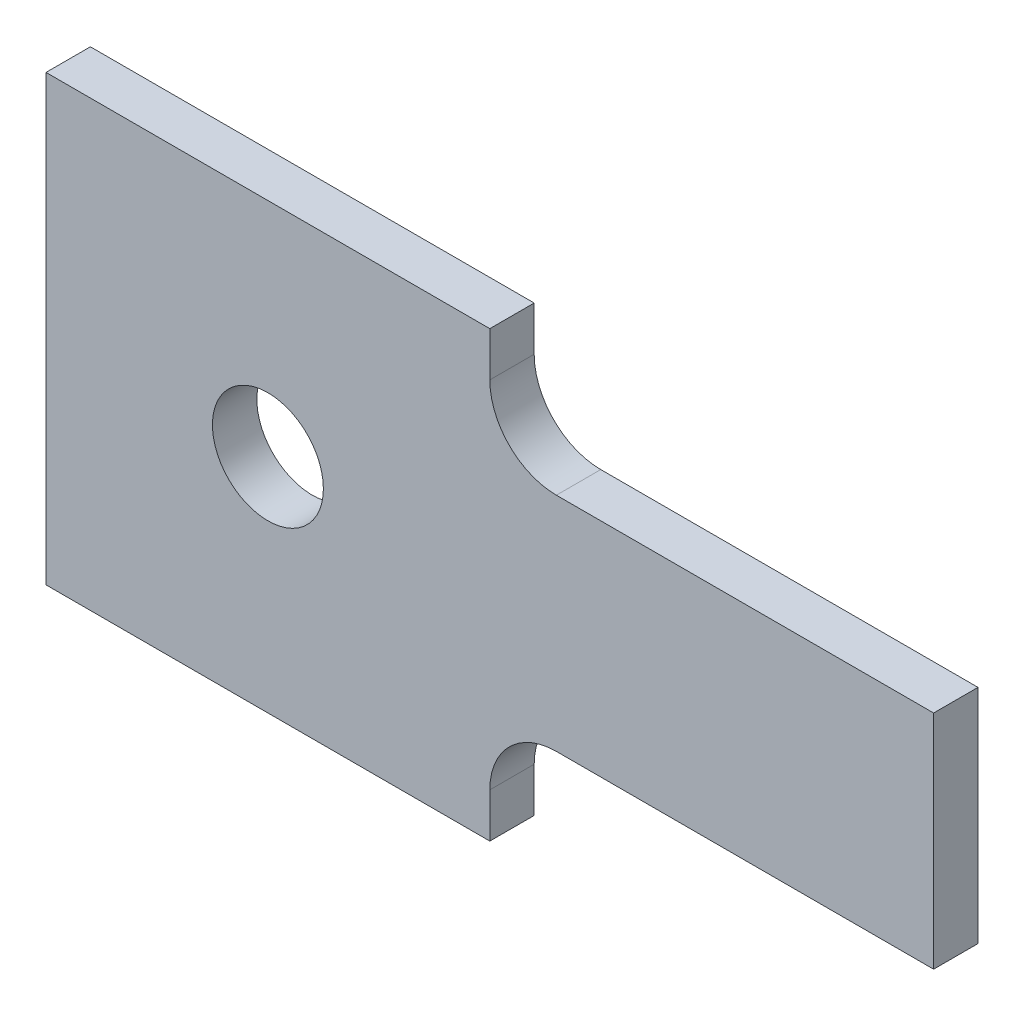
ISO-10303-21;
HEADER;
FILE_DESCRIPTION(('STEP AP214'),'2;1');
FILE_NAME('part.step','',(''),(''),'','','');
FILE_SCHEMA(('AUTOMOTIVE_DESIGN { 1 0 10303 214 1 1 1 1 }'));
ENDSEC;
DATA;
#1=APPLICATION_CONTEXT('core data for automotive mechanical design processes');
#2=APPLICATION_PROTOCOL_DEFINITION('international standard','automotive_design',2000,#1);
#3=PRODUCT_CONTEXT('',#1,'mechanical');
#4=PRODUCT('Part','Part','',(#3));
#5=PRODUCT_RELATED_PRODUCT_CATEGORY('part','',(#4));
#6=PRODUCT_DEFINITION_FORMATION('','',#4);
#7=PRODUCT_DEFINITION_CONTEXT('part definition',#1,'design');
#8=PRODUCT_DEFINITION('design','',#6,#7);
#9=PRODUCT_DEFINITION_SHAPE('','',#8);
#10=(LENGTH_UNIT() NAMED_UNIT(*) SI_UNIT(.MILLI.,.METRE.));
#11=(NAMED_UNIT(*) PLANE_ANGLE_UNIT() SI_UNIT($,.RADIAN.));
#12=(NAMED_UNIT(*) SI_UNIT($,.STERADIAN.) SOLID_ANGLE_UNIT());
#13=UNCERTAINTY_MEASURE_WITH_UNIT(LENGTH_MEASURE(1.E-05),#10,'distance_accuracy_value','');
#14=(GEOMETRIC_REPRESENTATION_CONTEXT(3) GLOBAL_UNCERTAINTY_ASSIGNED_CONTEXT((#13)) GLOBAL_UNIT_ASSIGNED_CONTEXT((#10,
#11,#12)) REPRESENTATION_CONTEXT('',''));
#15=CARTESIAN_POINT('',(0.,0.,0.));
#16=DIRECTION('',(0.,0.,1.));
#17=DIRECTION('',(1.,0.,0.));
#18=AXIS2_PLACEMENT_3D('',#15,#16,#17);
#19=CARTESIAN_POINT('',(0.,50.,10.));
#20=DIRECTION('',(1.,0.,0.));
#21=DIRECTION('',(0.,0.,-1.));
#22=AXIS2_PLACEMENT_3D('',#19,#20,#21);
#23=PLANE('',#22);
#24=DIRECTION('',(0.,-1.,0.));
#25=VECTOR('',#24,1.);
#26=CARTESIAN_POINT('',(0.,50.,5.));
#27=LINE('',#26,#25);
#28=CARTESIAN_POINT('',(0.,0.,5.));
#29=VERTEX_POINT('',#28);
#30=CARTESIAN_POINT('',(0.,-50.,5.));
#31=VERTEX_POINT('',#30);
#32=EDGE_CURVE('E11',#29,#31,#27,.T.);
#33=ORIENTED_EDGE('',*,*,#32,.F.);
#34=DIRECTION('',(0.,0.,1.));
#35=VECTOR('',#34,1.);
#36=CARTESIAN_POINT('',(0.,0.,10.));
#37=LINE('',#36,#35);
#38=CARTESIAN_POINT('',(0.,0.,0.));
#39=VERTEX_POINT('',#38);
#40=EDGE_CURVE('E159',#39,#29,#37,.T.);
#41=ORIENTED_EDGE('',*,*,#40,.F.);
#42=DIRECTION('',(0.,-1.,0.));
#43=VECTOR('',#42,1.);
#44=CARTESIAN_POINT('',(0.,50.,0.));
#45=LINE('',#44,#43);
#46=CARTESIAN_POINT('',(0.,-50.,0.));
#47=VERTEX_POINT('',#46);
#48=EDGE_CURVE('E193',#39,#47,#45,.T.);
#49=ORIENTED_EDGE('',*,*,#48,.T.);
#50=DIRECTION('',(0.,0.,-1.));
#51=VECTOR('',#50,1.);
#52=CARTESIAN_POINT('',(0.,-50.,10.));
#53=LINE('',#52,#51);
#54=EDGE_CURVE('E232',#31,#47,#53,.T.);
#55=ORIENTED_EDGE('',*,*,#54,.F.);
#56=EDGE_LOOP('',(#33,#41,#49,#55));
#57=FACE_BOUND('',#56,.T.);
#58=ADVANCED_FACE('F42',(#57),#23,.F.);
#59=DIRECTION('',(0.,-1.,0.));
#60=VECTOR('',#59,1.);
#61=CARTESIAN_POINT('',(0.,50.,5.));
#62=LINE('',#61,#60);
#63=CARTESIAN_POINT('',(0.,50.,5.));
#64=VERTEX_POINT('',#63);
#65=EDGE_CURVE('E46',#64,#29,#62,.T.);
#66=ORIENTED_EDGE('',*,*,#65,.F.);
#67=DIRECTION('',(0.,0.,-1.));
#68=VECTOR('',#67,1.);
#69=CARTESIAN_POINT('',(0.,50.,10.));
#70=LINE('',#69,#68);
#71=CARTESIAN_POINT('',(0.,50.,0.));
#72=VERTEX_POINT('',#71);
#73=EDGE_CURVE('E156',#64,#72,#70,.T.);
#74=ORIENTED_EDGE('',*,*,#73,.T.);
#75=EDGE_CURVE('E195',#72,#39,#45,.T.);
#76=ORIENTED_EDGE('',*,*,#75,.T.);
#77=ORIENTED_EDGE('',*,*,#40,.T.);
#78=EDGE_LOOP('',(#66,#74,#76,#77));
#79=FACE_BOUND('',#78,.T.);
#80=ADVANCED_FACE('F276',(#79),#23,.F.);
#81=CARTESIAN_POINT('',(0.,0.,10.));
#82=VERTEX_POINT('',#81);
#83=EDGE_CURVE('E139',#29,#82,#37,.T.);
#84=ORIENTED_EDGE('',*,*,#83,.F.);
#85=ORIENTED_EDGE('',*,*,#32,.T.);
#86=CARTESIAN_POINT('',(0.,-50.,10.));
#87=VERTEX_POINT('',#86);
#88=EDGE_CURVE('E161',#87,#31,#53,.T.);
#89=ORIENTED_EDGE('',*,*,#88,.F.);
#90=DIRECTION('',(0.,-1.,0.));
#91=VECTOR('',#90,1.);
#92=CARTESIAN_POINT('',(0.,50.,10.));
#93=LINE('',#92,#91);
#94=EDGE_CURVE('E143',#82,#87,#93,.T.);
#95=ORIENTED_EDGE('',*,*,#94,.F.);
#96=EDGE_LOOP('',(#84,#85,#89,#95));
#97=FACE_BOUND('',#96,.T.);
#98=ADVANCED_FACE('F171',(#97),#23,.F.);
#99=CARTESIAN_POINT('',(100.,50.,10.));
#100=DIRECTION('',(0.,-1.,0.));
#101=DIRECTION('',(1.,0.,0.));
#102=AXIS2_PLACEMENT_3D('',#99,#100,#101);
#103=PLANE('',#102);
#104=DIRECTION('',(-1.,0.,0.));
#105=VECTOR('',#104,1.);
#106=CARTESIAN_POINT('',(100.,50.,0.));
#107=LINE('',#106,#105);
#108=CARTESIAN_POINT('',(100.,50.,0.));
#109=VERTEX_POINT('',#108);
#110=EDGE_CURVE('E191',#109,#72,#107,.T.);
#111=ORIENTED_EDGE('',*,*,#110,.T.);
#112=ORIENTED_EDGE('',*,*,#73,.F.);
#113=CARTESIAN_POINT('',(0.,50.,10.));
#114=VERTEX_POINT('',#113);
#115=EDGE_CURVE('E138',#114,#64,#70,.T.);
#116=ORIENTED_EDGE('',*,*,#115,.F.);
#117=DIRECTION('',(-1.,0.,0.));
#118=VECTOR('',#117,1.);
#119=CARTESIAN_POINT('',(100.,50.,10.));
#120=LINE('',#119,#118);
#121=CARTESIAN_POINT('',(100.,50.,10.));
#122=VERTEX_POINT('',#121);
#123=EDGE_CURVE('E146',#122,#114,#120,.T.);
#124=ORIENTED_EDGE('',*,*,#123,.F.);
#125=DIRECTION('',(0.,0.,-1.));
#126=VECTOR('',#125,1.);
#127=CARTESIAN_POINT('',(100.,50.,10.));
#128=LINE('',#127,#126);
#129=EDGE_CURVE('E190',#122,#109,#128,.T.);
#130=ORIENTED_EDGE('',*,*,#129,.T.);
#131=EDGE_LOOP('',(#111,#112,#116,#124,#130));
#132=FACE_BOUND('',#131,.T.);
#133=ADVANCED_FACE('F44',(#132),#103,.F.);
#134=ORIENTED_EDGE('',*,*,#115,.T.);
#135=ORIENTED_EDGE('',*,*,#65,.T.);
#136=ORIENTED_EDGE('',*,*,#83,.T.);
#137=EDGE_CURVE('E134',#114,#82,#93,.T.);
#138=ORIENTED_EDGE('',*,*,#137,.F.);
#139=EDGE_LOOP('',(#134,#135,#136,#138));
#140=FACE_BOUND('',#139,.T.);
#141=ADVANCED_FACE('F136',(#140),#23,.F.);
#142=CARTESIAN_POINT('',(100.,-50.,10.));
#143=DIRECTION('',(0.,1.,0.));
#144=DIRECTION('',(-1.,0.,0.));
#145=AXIS2_PLACEMENT_3D('',#142,#143,#144);
#146=PLANE('',#145);
#147=DIRECTION('',(1.,0.,0.));
#148=VECTOR('',#147,1.);
#149=CARTESIAN_POINT('',(100.,-50.,0.));
#150=LINE('',#149,#148);
#151=CARTESIAN_POINT('',(100.,-50.,0.));
#152=VERTEX_POINT('',#151);
#153=EDGE_CURVE('E197',#47,#152,#150,.T.);
#154=ORIENTED_EDGE('',*,*,#153,.T.);
#155=DIRECTION('',(0.,0.,-1.));
#156=VECTOR('',#155,1.);
#157=CARTESIAN_POINT('',(100.,-50.,10.));
#158=LINE('',#157,#156);
#159=CARTESIAN_POINT('',(100.,-50.,10.));
#160=VERTEX_POINT('',#159);
#161=EDGE_CURVE('E230',#160,#152,#158,.T.);
#162=ORIENTED_EDGE('',*,*,#161,.F.);
#163=DIRECTION('',(1.,0.,0.));
#164=VECTOR('',#163,1.);
#165=CARTESIAN_POINT('',(100.,-50.,10.));
#166=LINE('',#165,#164);
#167=EDGE_CURVE('E142',#87,#160,#166,.T.);
#168=ORIENTED_EDGE('',*,*,#167,.F.);
#169=ORIENTED_EDGE('',*,*,#88,.T.);
#170=ORIENTED_EDGE('',*,*,#54,.T.);
#171=EDGE_LOOP('',(#154,#162,#168,#169,#170));
#172=FACE_BOUND('',#171,.T.);
#173=ADVANCED_FACE('F239',(#172),#146,.F.);
#174=CARTESIAN_POINT('',(100.,-40.0000000000001,10.));
#175=DIRECTION('',(-1.,0.,0.));
#176=DIRECTION('',(0.,0.,1.));
#177=AXIS2_PLACEMENT_3D('',#174,#175,#176);
#178=PLANE('',#177);
#179=DIRECTION('',(0.,1.,0.));
#180=VECTOR('',#179,1.);
#181=CARTESIAN_POINT('',(100.,-40.0000000000001,0.));
#182=LINE('',#181,#180);
#183=CARTESIAN_POINT('',(100.,-40.0000000000001,0.));
#184=VERTEX_POINT('',#183);
#185=EDGE_CURVE('E199',#152,#184,#182,.T.);
#186=ORIENTED_EDGE('',*,*,#185,.T.);
#187=DIRECTION('',(0.,0.,-1.));
#188=VECTOR('',#187,1.);
#189=CARTESIAN_POINT('',(100.,-40.0000000000001,10.));
#190=LINE('',#189,#188);
#191=CARTESIAN_POINT('',(100.,-40.0000000000001,10.));
#192=VERTEX_POINT('',#191);
#193=EDGE_CURVE('E228',#192,#184,#190,.T.);
#194=ORIENTED_EDGE('',*,*,#193,.F.);
#195=DIRECTION('',(0.,1.,0.));
#196=VECTOR('',#195,1.);
#197=CARTESIAN_POINT('',(100.,-40.0000000000001,10.));
#198=LINE('',#197,#196);
#199=EDGE_CURVE('E177',#160,#192,#198,.T.);
#200=ORIENTED_EDGE('',*,*,#199,.F.);
#201=ORIENTED_EDGE('',*,*,#161,.T.);
#202=EDGE_LOOP('',(#186,#194,#200,#201));
#203=FACE_BOUND('',#202,.T.);
#204=ADVANCED_FACE('F243',(#203),#178,.F.);
#205=CARTESIAN_POINT('',(115.,-40.,10.));
#206=DIRECTION('',(0.,0.,-1.));
#207=DIRECTION('',(-1.,0.,0.));
#208=AXIS2_PLACEMENT_3D('',#205,#206,#207);
#209=CYLINDRICAL_SURFACE('',#208,15.);
#210=CARTESIAN_POINT('',(115.,-40.,0.));
#211=DIRECTION('',(0.,0.,-1.));
#212=DIRECTION('',(1.,0.,0.));
#213=AXIS2_PLACEMENT_3D('',#210,#211,#212);
#214=CIRCLE('',#213,15.);
#215=CARTESIAN_POINT('',(115.,-25.,0.));
#216=VERTEX_POINT('',#215);
#217=EDGE_CURVE('E201',#184,#216,#214,.T.);
#218=ORIENTED_EDGE('',*,*,#217,.T.);
#219=DIRECTION('',(0.,0.,-1.));
#220=VECTOR('',#219,1.);
#221=CARTESIAN_POINT('',(115.,-25.,10.));
#222=LINE('',#221,#220);
#223=CARTESIAN_POINT('',(115.,-25.,10.));
#224=VERTEX_POINT('',#223);
#225=EDGE_CURVE('E225',#224,#216,#222,.T.);
#226=ORIENTED_EDGE('',*,*,#225,.F.);
#227=CARTESIAN_POINT('',(115.,-40.,10.));
#228=DIRECTION('',(0.,0.,-1.));
#229=DIRECTION('',(1.,0.,0.));
#230=AXIS2_PLACEMENT_3D('',#227,#228,#229);
#231=CIRCLE('',#230,15.);
#232=EDGE_CURVE('E179',#192,#224,#231,.T.);
#233=ORIENTED_EDGE('',*,*,#232,.F.);
#234=ORIENTED_EDGE('',*,*,#193,.T.);
#235=EDGE_LOOP('',(#218,#226,#233,#234));
#236=FACE_BOUND('',#235,.T.);
#237=ADVANCED_FACE('F246',(#236),#209,.F.);
#238=CARTESIAN_POINT('',(200.,-25.,10.));
#239=DIRECTION('',(0.,1.,0.));
#240=DIRECTION('',(-1.,0.,0.));
#241=AXIS2_PLACEMENT_3D('',#238,#239,#240);
#242=PLANE('',#241);
#243=DIRECTION('',(1.,0.,0.));
#244=VECTOR('',#243,1.);
#245=CARTESIAN_POINT('',(200.,-25.,0.));
#246=LINE('',#245,#244);
#247=CARTESIAN_POINT('',(200.,-25.,0.));
#248=VERTEX_POINT('',#247);
#249=EDGE_CURVE('E203',#216,#248,#246,.T.);
#250=ORIENTED_EDGE('',*,*,#249,.T.);
#251=DIRECTION('',(0.,0.,-1.));
#252=VECTOR('',#251,1.);
#253=CARTESIAN_POINT('',(200.,-25.,10.));
#254=LINE('',#253,#252);
#255=CARTESIAN_POINT('',(200.,-25.,10.));
#256=VERTEX_POINT('',#255);
#257=EDGE_CURVE('E222',#256,#248,#254,.T.);
#258=ORIENTED_EDGE('',*,*,#257,.F.);
#259=DIRECTION('',(1.,0.,0.));
#260=VECTOR('',#259,1.);
#261=CARTESIAN_POINT('',(200.,-25.,10.));
#262=LINE('',#261,#260);
#263=EDGE_CURVE('E181',#224,#256,#262,.T.);
#264=ORIENTED_EDGE('',*,*,#263,.F.);
#265=ORIENTED_EDGE('',*,*,#225,.T.);
#266=EDGE_LOOP('',(#250,#258,#264,#265));
#267=FACE_BOUND('',#266,.T.);
#268=ADVANCED_FACE('F251',(#267),#242,.F.);
#269=CARTESIAN_POINT('',(200.,-25.,10.));
#270=DIRECTION('',(-1.,0.,0.));
#271=DIRECTION('',(0.,0.,1.));
#272=AXIS2_PLACEMENT_3D('',#269,#270,#271);
#273=PLANE('',#272);
#274=DIRECTION('',(0.,1.,0.));
#275=VECTOR('',#274,1.);
#276=CARTESIAN_POINT('',(200.,-25.,0.));
#277=LINE('',#276,#275);
#278=CARTESIAN_POINT('',(200.,25.,0.));
#279=VERTEX_POINT('',#278);
#280=EDGE_CURVE('E205',#248,#279,#277,.T.);
#281=ORIENTED_EDGE('',*,*,#280,.T.);
#282=DIRECTION('',(0.,0.,-1.));
#283=VECTOR('',#282,1.);
#284=CARTESIAN_POINT('',(200.,25.,10.));
#285=LINE('',#284,#283);
#286=CARTESIAN_POINT('',(200.,25.,10.));
#287=VERTEX_POINT('',#286);
#288=EDGE_CURVE('E219',#287,#279,#285,.T.);
#289=ORIENTED_EDGE('',*,*,#288,.F.);
#290=DIRECTION('',(0.,1.,0.));
#291=VECTOR('',#290,1.);
#292=CARTESIAN_POINT('',(200.,-25.,10.));
#293=LINE('',#292,#291);
#294=EDGE_CURVE('E183',#256,#287,#293,.T.);
#295=ORIENTED_EDGE('',*,*,#294,.F.);
#296=ORIENTED_EDGE('',*,*,#257,.T.);
#297=EDGE_LOOP('',(#281,#289,#295,#296));
#298=FACE_BOUND('',#297,.T.);
#299=ADVANCED_FACE('F257',(#298),#273,.F.);
#300=CARTESIAN_POINT('',(200.,25.,10.));
#301=DIRECTION('',(0.,-1.,0.));
#302=DIRECTION('',(1.,0.,0.));
#303=AXIS2_PLACEMENT_3D('',#300,#301,#302);
#304=PLANE('',#303);
#305=DIRECTION('',(-1.,0.,0.));
#306=VECTOR('',#305,1.);
#307=CARTESIAN_POINT('',(200.,25.,0.));
#308=LINE('',#307,#306);
#309=CARTESIAN_POINT('',(115.,25.,0.));
#310=VERTEX_POINT('',#309);
#311=EDGE_CURVE('E207',#279,#310,#308,.T.);
#312=ORIENTED_EDGE('',*,*,#311,.T.);
#313=DIRECTION('',(0.,0.,-1.));
#314=VECTOR('',#313,1.);
#315=CARTESIAN_POINT('',(115.,25.,10.));
#316=LINE('',#315,#314);
#317=CARTESIAN_POINT('',(115.,25.,10.));
#318=VERTEX_POINT('',#317);
#319=EDGE_CURVE('E216',#318,#310,#316,.T.);
#320=ORIENTED_EDGE('',*,*,#319,.F.);
#321=DIRECTION('',(-1.,0.,0.));
#322=VECTOR('',#321,1.);
#323=CARTESIAN_POINT('',(200.,25.,10.));
#324=LINE('',#323,#322);
#325=EDGE_CURVE('E185',#287,#318,#324,.T.);
#326=ORIENTED_EDGE('',*,*,#325,.F.);
#327=ORIENTED_EDGE('',*,*,#288,.T.);
#328=EDGE_LOOP('',(#312,#320,#326,#327));
#329=FACE_BOUND('',#328,.T.);
#330=ADVANCED_FACE('F261',(#329),#304,.F.);
#331=CARTESIAN_POINT('',(115.,40.,10.));
#332=DIRECTION('',(0.,0.,-1.));
#333=DIRECTION('',(-1.,0.,0.));
#334=AXIS2_PLACEMENT_3D('',#331,#332,#333);
#335=CYLINDRICAL_SURFACE('',#334,15.);
#336=CARTESIAN_POINT('',(115.,40.,0.));
#337=DIRECTION('',(0.,0.,-1.));
#338=DIRECTION('',(-1.,0.,0.));
#339=AXIS2_PLACEMENT_3D('',#336,#337,#338);
#340=CIRCLE('',#339,15.);
#341=CARTESIAN_POINT('',(100.,40.0000000000001,0.));
#342=VERTEX_POINT('',#341);
#343=EDGE_CURVE('E209',#310,#342,#340,.T.);
#344=ORIENTED_EDGE('',*,*,#343,.T.);
#345=DIRECTION('',(0.,0.,-1.));
#346=VECTOR('',#345,1.);
#347=CARTESIAN_POINT('',(100.,40.0000000000001,10.));
#348=LINE('',#347,#346);
#349=CARTESIAN_POINT('',(100.,40.0000000000001,10.));
#350=VERTEX_POINT('',#349);
#351=EDGE_CURVE('E213',#350,#342,#348,.T.);
#352=ORIENTED_EDGE('',*,*,#351,.F.);
#353=CARTESIAN_POINT('',(115.,40.,10.));
#354=DIRECTION('',(0.,0.,-1.));
#355=DIRECTION('',(-1.,0.,0.));
#356=AXIS2_PLACEMENT_3D('',#353,#354,#355);
#357=CIRCLE('',#356,15.);
#358=EDGE_CURVE('E187',#318,#350,#357,.T.);
#359=ORIENTED_EDGE('',*,*,#358,.F.);
#360=ORIENTED_EDGE('',*,*,#319,.T.);
#361=EDGE_LOOP('',(#344,#352,#359,#360));
#362=FACE_BOUND('',#361,.T.);
#363=ADVANCED_FACE('F266',(#362),#335,.F.);
#364=CARTESIAN_POINT('',(100.,40.0000000000001,10.));
#365=DIRECTION('',(-1.,0.,0.));
#366=DIRECTION('',(0.,0.,1.));
#367=AXIS2_PLACEMENT_3D('',#364,#365,#366);
#368=PLANE('',#367);
#369=DIRECTION('',(0.,1.,0.));
#370=VECTOR('',#369,1.);
#371=CARTESIAN_POINT('',(100.,40.0000000000001,0.));
#372=LINE('',#371,#370);
#373=EDGE_CURVE('E153',#342,#109,#372,.T.);
#374=ORIENTED_EDGE('',*,*,#373,.T.);
#375=ORIENTED_EDGE('',*,*,#129,.F.);
#376=DIRECTION('',(0.,1.,0.));
#377=VECTOR('',#376,1.);
#378=CARTESIAN_POINT('',(100.,40.0000000000001,10.));
#379=LINE('',#378,#377);
#380=EDGE_CURVE('E149',#350,#122,#379,.T.);
#381=ORIENTED_EDGE('',*,*,#380,.F.);
#382=ORIENTED_EDGE('',*,*,#351,.T.);
#383=EDGE_LOOP('',(#374,#375,#381,#382));
#384=FACE_BOUND('',#383,.T.);
#385=ADVANCED_FACE('F269',(#384),#368,.F.);
#386=CARTESIAN_POINT('',(115.,-40.,10.));
#387=DIRECTION('',(0.,0.,1.));
#388=DIRECTION('',(1.,0.,0.));
#389=AXIS2_PLACEMENT_3D('',#386,#387,#388);
#390=PLANE('',#389);
#391=CARTESIAN_POINT('',(50.,0.,10.));
#392=DIRECTION('',(0.,0.,1.));
#393=DIRECTION('',(1.,0.,0.));
#394=AXIS2_PLACEMENT_3D('',#391,#392,#393);
#395=CIRCLE('',#394,12.5);
#396=CARTESIAN_POINT('',(62.5,0.,10.));
#397=VERTEX_POINT('',#396);
#398=EDGE_CURVE('E317',#397,#397,#395,.T.);
#399=ORIENTED_EDGE('',*,*,#398,.F.);
#400=EDGE_LOOP('',(#399));
#401=FACE_BOUND('',#400,.T.);
#402=ORIENTED_EDGE('',*,*,#123,.T.);
#403=ORIENTED_EDGE('',*,*,#137,.T.);
#404=ORIENTED_EDGE('',*,*,#94,.T.);
#405=ORIENTED_EDGE('',*,*,#167,.T.);
#406=ORIENTED_EDGE('',*,*,#199,.T.);
#407=ORIENTED_EDGE('',*,*,#232,.T.);
#408=ORIENTED_EDGE('',*,*,#263,.T.);
#409=ORIENTED_EDGE('',*,*,#294,.T.);
#410=ORIENTED_EDGE('',*,*,#325,.T.);
#411=ORIENTED_EDGE('',*,*,#358,.T.);
#412=ORIENTED_EDGE('',*,*,#380,.T.);
#413=EDGE_LOOP('',(#402,#403,#404,#405,#406,#407,#408,#409,#410,#411,#412));
#414=FACE_BOUND('',#413,.T.);
#415=ADVANCED_FACE('F147',(#401,#414),#390,.T.);
#416=CARTESIAN_POINT('',(115.,-40.,0.));
#417=DIRECTION('',(0.,0.,1.));
#418=DIRECTION('',(1.,0.,0.));
#419=AXIS2_PLACEMENT_3D('',#416,#417,#418);
#420=PLANE('',#419);
#421=CARTESIAN_POINT('',(50.,0.,0.));
#422=DIRECTION('',(0.,0.,1.));
#423=DIRECTION('',(1.,0.,0.));
#424=AXIS2_PLACEMENT_3D('',#421,#422,#423);
#425=CIRCLE('',#424,12.5);
#426=CARTESIAN_POINT('',(62.5,0.,0.));
#427=VERTEX_POINT('',#426);
#428=EDGE_CURVE('E194',#427,#427,#425,.T.);
#429=ORIENTED_EDGE('',*,*,#428,.T.);
#430=EDGE_LOOP('',(#429));
#431=FACE_BOUND('',#430,.T.);
#432=ORIENTED_EDGE('',*,*,#110,.F.);
#433=ORIENTED_EDGE('',*,*,#373,.F.);
#434=ORIENTED_EDGE('',*,*,#343,.F.);
#435=ORIENTED_EDGE('',*,*,#311,.F.);
#436=ORIENTED_EDGE('',*,*,#280,.F.);
#437=ORIENTED_EDGE('',*,*,#249,.F.);
#438=ORIENTED_EDGE('',*,*,#217,.F.);
#439=ORIENTED_EDGE('',*,*,#185,.F.);
#440=ORIENTED_EDGE('',*,*,#153,.F.);
#441=ORIENTED_EDGE('',*,*,#48,.F.);
#442=ORIENTED_EDGE('',*,*,#75,.F.);
#443=EDGE_LOOP('',(#432,#433,#434,#435,#436,#437,#438,#439,#440,#441,#442));
#444=FACE_BOUND('',#443,.T.);
#445=ADVANCED_FACE('F273',(#431,#444),#420,.F.);
#446=CARTESIAN_POINT('',(50.,0.,0.));
#447=DIRECTION('',(0.,0.,1.));
#448=DIRECTION('',(1.,0.,0.));
#449=AXIS2_PLACEMENT_3D('',#446,#447,#448);
#450=CYLINDRICAL_SURFACE('',#449,12.5);
#451=ORIENTED_EDGE('',*,*,#428,.F.);
#452=EDGE_LOOP('',(#451));
#453=FACE_BOUND('',#452,.T.);
#454=ORIENTED_EDGE('',*,*,#398,.T.);
#455=EDGE_LOOP('',(#454));
#456=FACE_BOUND('',#455,.T.);
#457=ADVANCED_FACE('F303',(#453,#456),#450,.F.);
#458=CLOSED_SHELL('',(#58,#80,#98,#133,#141,#173,#204,#237,#268,#299,#330,#363,#385,#415,#445,#457));
#459=MANIFOLD_SOLID_BREP('B2',#458);
#460=ADVANCED_BREP_SHAPE_REPRESENTATION('',(#18,#459),#14);
#461=SHAPE_DEFINITION_REPRESENTATION(#9,#460);
ENDSEC;
END-ISO-10303-21;
